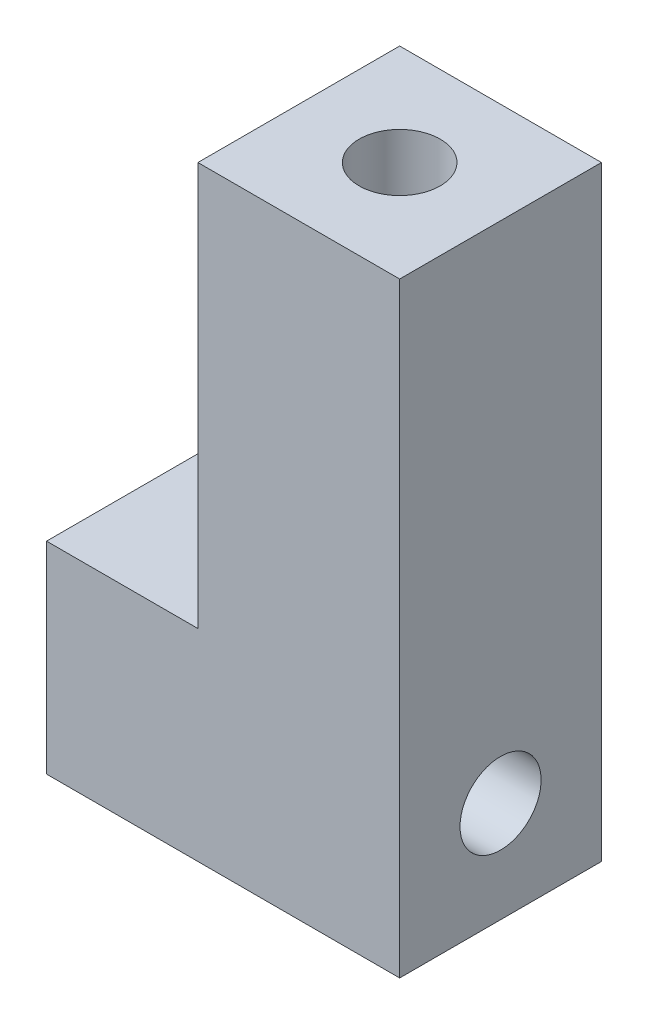
ISO-10303-21;
HEADER;
FILE_DESCRIPTION(('STEP AP214'),'2;1');
FILE_NAME('part.step','',(''),(''),'','','');
FILE_SCHEMA(('AUTOMOTIVE_DESIGN { 1 0 10303 214 1 1 1 1 }'));
ENDSEC;
DATA;
#1=APPLICATION_CONTEXT('core data for automotive mechanical design processes');
#2=APPLICATION_PROTOCOL_DEFINITION('international standard','automotive_design',2000,#1);
#3=PRODUCT_CONTEXT('',#1,'mechanical');
#4=PRODUCT('Part','Part','',(#3));
#5=PRODUCT_RELATED_PRODUCT_CATEGORY('part','',(#4));
#6=PRODUCT_DEFINITION_FORMATION('','',#4);
#7=PRODUCT_DEFINITION_CONTEXT('part definition',#1,'design');
#8=PRODUCT_DEFINITION('design','',#6,#7);
#9=PRODUCT_DEFINITION_SHAPE('','',#8);
#10=(LENGTH_UNIT() NAMED_UNIT(*) SI_UNIT(.MILLI.,.METRE.));
#11=(NAMED_UNIT(*) PLANE_ANGLE_UNIT() SI_UNIT($,.RADIAN.));
#12=(NAMED_UNIT(*) SI_UNIT($,.STERADIAN.) SOLID_ANGLE_UNIT());
#13=UNCERTAINTY_MEASURE_WITH_UNIT(LENGTH_MEASURE(1.E-05),#10,'distance_accuracy_value','');
#14=(GEOMETRIC_REPRESENTATION_CONTEXT(3) GLOBAL_UNCERTAINTY_ASSIGNED_CONTEXT((#13)) GLOBAL_UNIT_ASSIGNED_CONTEXT((#10,
#11,#12)) REPRESENTATION_CONTEXT('',''));
#15=CARTESIAN_POINT('',(0.,0.,0.));
#16=DIRECTION('',(0.,0.,1.));
#17=DIRECTION('',(1.,0.,0.));
#18=AXIS2_PLACEMENT_3D('',#15,#16,#17);
#19=CARTESIAN_POINT('',(-6.35000000000002,38.1,6.35));
#20=DIRECTION('',(0.,1.,0.));
#21=DIRECTION('',(0.,0.,1.));
#22=AXIS2_PLACEMENT_3D('',#19,#20,#21);
#23=CYLINDRICAL_SURFACE('',#22,2.55269999999999);
#24=CARTESIAN_POINT('',(-6.35000000000002,38.1,6.35));
#25=DIRECTION('',(0.,1.,0.));
#26=DIRECTION('',(0.,0.,1.));
#27=AXIS2_PLACEMENT_3D('',#24,#25,#26);
#28=CIRCLE('',#27,2.55269999999999);
#29=CARTESIAN_POINT('',(-6.35000000000002,38.1,8.90269999999999));
#30=VERTEX_POINT('',#29);
#31=EDGE_CURVE('E261',#30,#30,#28,.T.);
#32=ORIENTED_EDGE('',*,*,#31,.T.);
#33=EDGE_LOOP('',(#32));
#34=FACE_BOUND('',#33,.T.);
#35=CARTESIAN_POINT('',(-6.35000000000002,6.35,6.35));
#36=DIRECTION('',(0.707106781186547,0.707106781186547,0.));
#37=DIRECTION('',(-0.707106781186547,0.707106781186547,0.));
#38=AXIS2_PLACEMENT_3D('',#35,#36,#37);
#39=ELLIPSE('',#38,3.61006296066979,2.55269999999999);
#40=CARTESIAN_POINT('',(-6.35000000000002,6.35,8.90269999999999));
#41=VERTEX_POINT('',#40);
#42=CARTESIAN_POINT('',(-6.35000000000002,6.35,3.79730000000001));
#43=VERTEX_POINT('',#42);
#44=EDGE_CURVE('E58',#41,#43,#39,.F.);
#45=ORIENTED_EDGE('',*,*,#44,.T.);
#46=CARTESIAN_POINT('',(-6.35000000000002,6.35,6.35));
#47=DIRECTION('',(-0.707106781186547,0.707106781186547,0.));
#48=DIRECTION('',(0.707106781186547,0.707106781186547,0.));
#49=AXIS2_PLACEMENT_3D('',#46,#47,#48);
#50=ELLIPSE('',#49,3.61006296066979,2.55269999999999);
#51=EDGE_CURVE('E11',#43,#41,#50,.F.);
#52=ORIENTED_EDGE('',*,*,#51,.T.);
#53=EDGE_LOOP('',(#45,#52));
#54=FACE_BOUND('',#53,.T.);
#55=ADVANCED_FACE('F41',(#34,#54),#23,.F.);
#56=CARTESIAN_POINT('',(-22.225,0.,12.7));
#57=DIRECTION('',(0.,1.,0.));
#58=DIRECTION('',(-1.,0.,0.));
#59=AXIS2_PLACEMENT_3D('',#56,#57,#58);
#60=PLANE('',#59);
#61=CARTESIAN_POINT('',(-6.35000000000002,0.,6.35));
#62=DIRECTION('',(0.,1.,0.));
#63=DIRECTION('',(0.,0.,1.));
#64=AXIS2_PLACEMENT_3D('',#61,#62,#63);
#65=CIRCLE('',#64,2.55269999999999);
#66=CARTESIAN_POINT('',(-6.35000000000002,0.,8.90269999999999));
#67=VERTEX_POINT('',#66);
#68=EDGE_CURVE('E160',#67,#67,#65,.T.);
#69=ORIENTED_EDGE('',*,*,#68,.T.);
#70=EDGE_LOOP('',(#69));
#71=FACE_BOUND('',#70,.T.);
#72=DIRECTION('',(1.,0.,0.));
#73=VECTOR('',#72,1.);
#74=CARTESIAN_POINT('',(-22.225,0.,0.));
#75=LINE('',#74,#73);
#76=CARTESIAN_POINT('',(-22.225,0.,0.));
#77=VERTEX_POINT('',#76);
#78=CARTESIAN_POINT('',(0.,0.,0.));
#79=VERTEX_POINT('',#78);
#80=EDGE_CURVE('E155',#77,#79,#75,.T.);
#81=ORIENTED_EDGE('',*,*,#80,.T.);
#82=DIRECTION('',(0.,0.,-1.));
#83=VECTOR('',#82,1.);
#84=CARTESIAN_POINT('',(0.,0.,12.7));
#85=LINE('',#84,#83);
#86=CARTESIAN_POINT('',(0.,0.,12.7));
#87=VERTEX_POINT('',#86);
#88=EDGE_CURVE('E183',#87,#79,#85,.T.);
#89=ORIENTED_EDGE('',*,*,#88,.F.);
#90=DIRECTION('',(1.,0.,0.));
#91=VECTOR('',#90,1.);
#92=CARTESIAN_POINT('',(-22.225,0.,12.7));
#93=LINE('',#92,#91);
#94=CARTESIAN_POINT('',(-22.225,0.,12.7));
#95=VERTEX_POINT('',#94);
#96=EDGE_CURVE('E172',#95,#87,#93,.T.);
#97=ORIENTED_EDGE('',*,*,#96,.F.);
#98=DIRECTION('',(0.,0.,-1.));
#99=VECTOR('',#98,1.);
#100=CARTESIAN_POINT('',(-22.225,0.,12.7));
#101=LINE('',#100,#99);
#102=EDGE_CURVE('E151',#95,#77,#101,.T.);
#103=ORIENTED_EDGE('',*,*,#102,.T.);
#104=EDGE_LOOP('',(#81,#89,#97,#103));
#105=FACE_BOUND('',#104,.T.);
#106=ADVANCED_FACE('F43',(#71,#105),#60,.F.);
#107=CARTESIAN_POINT('',(0.,0.,12.7));
#108=DIRECTION('',(-1.,0.,0.));
#109=DIRECTION('',(0.,0.,1.));
#110=AXIS2_PLACEMENT_3D('',#107,#108,#109);
#111=PLANE('',#110);
#112=CARTESIAN_POINT('',(0.,6.35,6.35));
#113=DIRECTION('',(-1.,0.,0.));
#114=DIRECTION('',(0.,0.,1.));
#115=AXIS2_PLACEMENT_3D('',#112,#113,#114);
#116=CIRCLE('',#115,2.5527);
#117=CARTESIAN_POINT('',(0.,6.35,8.9027));
#118=VERTEX_POINT('',#117);
#119=EDGE_CURVE('E245',#118,#118,#116,.T.);
#120=ORIENTED_EDGE('',*,*,#119,.T.);
#121=EDGE_LOOP('',(#120));
#122=FACE_BOUND('',#121,.T.);
#123=DIRECTION('',(0.,1.,0.));
#124=VECTOR('',#123,1.);
#125=CARTESIAN_POINT('',(0.,0.,0.));
#126=LINE('',#125,#124);
#127=CARTESIAN_POINT('',(0.,38.1,0.));
#128=VERTEX_POINT('',#127);
#129=EDGE_CURVE('E159',#79,#128,#126,.T.);
#130=ORIENTED_EDGE('',*,*,#129,.T.);
#131=DIRECTION('',(0.,0.,-1.));
#132=VECTOR('',#131,1.);
#133=CARTESIAN_POINT('',(0.,38.1,12.7));
#134=LINE('',#133,#132);
#135=CARTESIAN_POINT('',(0.,38.1,12.7));
#136=VERTEX_POINT('',#135);
#137=EDGE_CURVE('E179',#136,#128,#134,.T.);
#138=ORIENTED_EDGE('',*,*,#137,.F.);
#139=DIRECTION('',(0.,1.,0.));
#140=VECTOR('',#139,1.);
#141=CARTESIAN_POINT('',(0.,0.,12.7));
#142=LINE('',#141,#140);
#143=EDGE_CURVE('E113',#87,#136,#142,.T.);
#144=ORIENTED_EDGE('',*,*,#143,.F.);
#145=ORIENTED_EDGE('',*,*,#88,.T.);
#146=EDGE_LOOP('',(#130,#138,#144,#145));
#147=FACE_BOUND('',#146,.T.);
#148=ADVANCED_FACE('F209',(#122,#147),#111,.F.);
#149=CARTESIAN_POINT('',(0.,38.1,12.7));
#150=DIRECTION('',(0.,-1.,0.));
#151=DIRECTION('',(1.,0.,0.));
#152=AXIS2_PLACEMENT_3D('',#149,#150,#151);
#153=PLANE('',#152);
#154=ORIENTED_EDGE('',*,*,#31,.F.);
#155=EDGE_LOOP('',(#154));
#156=FACE_BOUND('',#155,.T.);
#157=DIRECTION('',(-1.,0.,0.));
#158=VECTOR('',#157,1.);
#159=CARTESIAN_POINT('',(0.,38.1,0.));
#160=LINE('',#159,#158);
#161=CARTESIAN_POINT('',(-12.7,38.1,0.));
#162=VERTEX_POINT('',#161);
#163=EDGE_CURVE('E163',#128,#162,#160,.T.);
#164=ORIENTED_EDGE('',*,*,#163,.T.);
#165=DIRECTION('',(0.,0.,-1.));
#166=VECTOR('',#165,1.);
#167=CARTESIAN_POINT('',(-12.7,38.1,12.7));
#168=LINE('',#167,#166);
#169=CARTESIAN_POINT('',(-12.7,38.1,12.7));
#170=VERTEX_POINT('',#169);
#171=EDGE_CURVE('E143',#170,#162,#168,.T.);
#172=ORIENTED_EDGE('',*,*,#171,.F.);
#173=DIRECTION('',(-1.,0.,0.));
#174=VECTOR('',#173,1.);
#175=CARTESIAN_POINT('',(0.,38.1,12.7));
#176=LINE('',#175,#174);
#177=EDGE_CURVE('E129',#136,#170,#176,.T.);
#178=ORIENTED_EDGE('',*,*,#177,.F.);
#179=ORIENTED_EDGE('',*,*,#137,.T.);
#180=EDGE_LOOP('',(#164,#172,#178,#179));
#181=FACE_BOUND('',#180,.T.);
#182=ADVANCED_FACE('F236',(#156,#181),#153,.F.);
#183=CARTESIAN_POINT('',(-12.7,38.1,12.7));
#184=DIRECTION('',(1.,0.,0.));
#185=DIRECTION('',(0.,1.,0.));
#186=AXIS2_PLACEMENT_3D('',#183,#184,#185);
#187=PLANE('',#186);
#188=DIRECTION('',(0.,-1.,0.));
#189=VECTOR('',#188,1.);
#190=CARTESIAN_POINT('',(-12.7,38.1,0.));
#191=LINE('',#190,#189);
#192=CARTESIAN_POINT('',(-12.7,12.7,0.));
#193=VERTEX_POINT('',#192);
#194=EDGE_CURVE('E139',#162,#193,#191,.T.);
#195=ORIENTED_EDGE('',*,*,#194,.T.);
#196=DIRECTION('',(0.,0.,-1.));
#197=VECTOR('',#196,1.);
#198=CARTESIAN_POINT('',(-12.7,12.7,12.7));
#199=LINE('',#198,#197);
#200=CARTESIAN_POINT('',(-12.7,12.7,12.7));
#201=VERTEX_POINT('',#200);
#202=EDGE_CURVE('E136',#201,#193,#199,.T.);
#203=ORIENTED_EDGE('',*,*,#202,.F.);
#204=DIRECTION('',(0.,-1.,0.));
#205=VECTOR('',#204,1.);
#206=CARTESIAN_POINT('',(-12.7,38.1,12.7));
#207=LINE('',#206,#205);
#208=EDGE_CURVE('E122',#170,#201,#207,.T.);
#209=ORIENTED_EDGE('',*,*,#208,.F.);
#210=ORIENTED_EDGE('',*,*,#171,.T.);
#211=EDGE_LOOP('',(#195,#203,#209,#210));
#212=FACE_BOUND('',#211,.T.);
#213=ADVANCED_FACE('F137',(#212),#187,.F.);
#214=CARTESIAN_POINT('',(-12.7,12.7,12.7));
#215=DIRECTION('',(0.,-1.,0.));
#216=DIRECTION('',(1.,0.,0.));
#217=AXIS2_PLACEMENT_3D('',#214,#215,#216);
#218=PLANE('',#217);
#219=DIRECTION('',(-1.,0.,0.));
#220=VECTOR('',#219,1.);
#221=CARTESIAN_POINT('',(-12.7,12.7,0.));
#222=LINE('',#221,#220);
#223=CARTESIAN_POINT('',(-22.225,12.7,0.));
#224=VERTEX_POINT('',#223);
#225=EDGE_CURVE('E167',#193,#224,#222,.T.);
#226=ORIENTED_EDGE('',*,*,#225,.T.);
#227=DIRECTION('',(0.,0.,-1.));
#228=VECTOR('',#227,1.);
#229=CARTESIAN_POINT('',(-22.225,12.7,12.7));
#230=LINE('',#229,#228);
#231=CARTESIAN_POINT('',(-22.225,12.7,12.7));
#232=VERTEX_POINT('',#231);
#233=EDGE_CURVE('E144',#232,#224,#230,.T.);
#234=ORIENTED_EDGE('',*,*,#233,.F.);
#235=DIRECTION('',(-1.,0.,0.));
#236=VECTOR('',#235,1.);
#237=CARTESIAN_POINT('',(-12.7,12.7,12.7));
#238=LINE('',#237,#236);
#239=EDGE_CURVE('E126',#201,#232,#238,.T.);
#240=ORIENTED_EDGE('',*,*,#239,.F.);
#241=ORIENTED_EDGE('',*,*,#202,.T.);
#242=EDGE_LOOP('',(#226,#234,#240,#241));
#243=FACE_BOUND('',#242,.T.);
#244=ADVANCED_FACE('F146',(#243),#218,.F.);
#245=CARTESIAN_POINT('',(-22.225,12.7,12.7));
#246=DIRECTION('',(1.,0.,0.));
#247=DIRECTION('',(0.,0.,-1.));
#248=AXIS2_PLACEMENT_3D('',#245,#246,#247);
#249=PLANE('',#248);
#250=CARTESIAN_POINT('',(-22.225,6.35,6.35));
#251=DIRECTION('',(-1.,0.,0.));
#252=DIRECTION('',(0.,0.,1.));
#253=AXIS2_PLACEMENT_3D('',#250,#251,#252);
#254=CIRCLE('',#253,2.55269999999999);
#255=CARTESIAN_POINT('',(-22.225,6.35,8.90269999999999));
#256=VERTEX_POINT('',#255);
#257=EDGE_CURVE('E264',#256,#256,#254,.T.);
#258=ORIENTED_EDGE('',*,*,#257,.F.);
#259=EDGE_LOOP('',(#258));
#260=FACE_BOUND('',#259,.T.);
#261=DIRECTION('',(0.,-1.,0.));
#262=VECTOR('',#261,1.);
#263=CARTESIAN_POINT('',(-22.225,12.7,0.));
#264=LINE('',#263,#262);
#265=EDGE_CURVE('E102',#224,#77,#264,.T.);
#266=ORIENTED_EDGE('',*,*,#265,.T.);
#267=ORIENTED_EDGE('',*,*,#102,.F.);
#268=DIRECTION('',(0.,-1.,0.));
#269=VECTOR('',#268,1.);
#270=CARTESIAN_POINT('',(-22.225,12.7,12.7));
#271=LINE('',#270,#269);
#272=EDGE_CURVE('E70',#232,#95,#271,.T.);
#273=ORIENTED_EDGE('',*,*,#272,.F.);
#274=ORIENTED_EDGE('',*,*,#233,.T.);
#275=EDGE_LOOP('',(#266,#267,#273,#274));
#276=FACE_BOUND('',#275,.T.);
#277=ADVANCED_FACE('F226',(#260,#276),#249,.F.);
#278=CARTESIAN_POINT('',(0.,0.,12.7));
#279=DIRECTION('',(0.,0.,1.));
#280=DIRECTION('',(1.,0.,0.));
#281=AXIS2_PLACEMENT_3D('',#278,#279,#280);
#282=PLANE('',#281);
#283=ORIENTED_EDGE('',*,*,#96,.T.);
#284=ORIENTED_EDGE('',*,*,#143,.T.);
#285=ORIENTED_EDGE('',*,*,#177,.T.);
#286=ORIENTED_EDGE('',*,*,#208,.T.);
#287=ORIENTED_EDGE('',*,*,#239,.T.);
#288=ORIENTED_EDGE('',*,*,#272,.T.);
#289=EDGE_LOOP('',(#283,#284,#285,#286,#287,#288));
#290=FACE_BOUND('',#289,.T.);
#291=ADVANCED_FACE('F124',(#290),#282,.T.);
#292=CARTESIAN_POINT('',(0.,0.,0.));
#293=DIRECTION('',(0.,0.,1.));
#294=DIRECTION('',(1.,0.,0.));
#295=AXIS2_PLACEMENT_3D('',#292,#293,#294);
#296=PLANE('',#295);
#297=ORIENTED_EDGE('',*,*,#80,.F.);
#298=ORIENTED_EDGE('',*,*,#265,.F.);
#299=ORIENTED_EDGE('',*,*,#225,.F.);
#300=ORIENTED_EDGE('',*,*,#194,.F.);
#301=ORIENTED_EDGE('',*,*,#163,.F.);
#302=ORIENTED_EDGE('',*,*,#129,.F.);
#303=EDGE_LOOP('',(#297,#298,#299,#300,#301,#302));
#304=FACE_BOUND('',#303,.T.);
#305=ADVANCED_FACE('F215',(#304),#296,.F.);
#306=CARTESIAN_POINT('',(-6.35000000000002,6.35,6.35));
#307=DIRECTION('',(0.707106781186547,0.707106781186547,0.));
#308=DIRECTION('',(-0.707106781186547,0.707106781186547,0.));
#309=AXIS2_PLACEMENT_3D('',#306,#307,#308);
#310=ELLIPSE('',#309,3.61006296066979,2.55269999999999);
#311=EDGE_CURVE('E188',#41,#43,#310,.T.);
#312=ORIENTED_EDGE('',*,*,#311,.T.);
#313=CARTESIAN_POINT('',(-6.35000000000002,6.35,6.35));
#314=DIRECTION('',(-0.707106781186547,0.707106781186547,0.));
#315=DIRECTION('',(0.707106781186547,0.707106781186547,0.));
#316=AXIS2_PLACEMENT_3D('',#313,#314,#315);
#317=ELLIPSE('',#316,3.61006296066979,2.55269999999999);
#318=EDGE_CURVE('E50',#43,#41,#317,.T.);
#319=ORIENTED_EDGE('',*,*,#318,.T.);
#320=EDGE_LOOP('',(#312,#319));
#321=FACE_BOUND('',#320,.T.);
#322=ORIENTED_EDGE('',*,*,#68,.F.);
#323=EDGE_LOOP('',(#322));
#324=FACE_BOUND('',#323,.T.);
#325=ADVANCED_FACE('F195',(#321,#324),#23,.F.);
#326=CARTESIAN_POINT('',(-22.225,6.35,6.35));
#327=DIRECTION('',(-1.,0.,0.));
#328=DIRECTION('',(0.,0.,1.));
#329=AXIS2_PLACEMENT_3D('',#326,#327,#328);
#330=CYLINDRICAL_SURFACE('',#329,2.55269999999999);
#331=ORIENTED_EDGE('',*,*,#257,.T.);
#332=EDGE_LOOP('',(#331));
#333=FACE_BOUND('',#332,.T.);
#334=ORIENTED_EDGE('',*,*,#44,.F.);
#335=ORIENTED_EDGE('',*,*,#318,.F.);
#336=EDGE_LOOP('',(#334,#335));
#337=FACE_BOUND('',#336,.T.);
#338=ADVANCED_FACE('F200',(#333,#337),#330,.F.);
#339=ORIENTED_EDGE('',*,*,#119,.F.);
#340=EDGE_LOOP('',(#339));
#341=FACE_BOUND('',#340,.T.);
#342=ORIENTED_EDGE('',*,*,#311,.F.);
#343=ORIENTED_EDGE('',*,*,#51,.F.);
#344=EDGE_LOOP('',(#342,#343));
#345=FACE_BOUND('',#344,.T.);
#346=ADVANCED_FACE('F202',(#341,#345),#330,.F.);
#347=CLOSED_SHELL('',(#55,#106,#148,#182,#213,#244,#277,#291,#305,#325,#338,#346));
#348=MANIFOLD_SOLID_BREP('B2',#347);
#349=ADVANCED_BREP_SHAPE_REPRESENTATION('',(#18,#348),#14);
#350=SHAPE_DEFINITION_REPRESENTATION(#9,#349);
ENDSEC;
END-ISO-10303-21;
